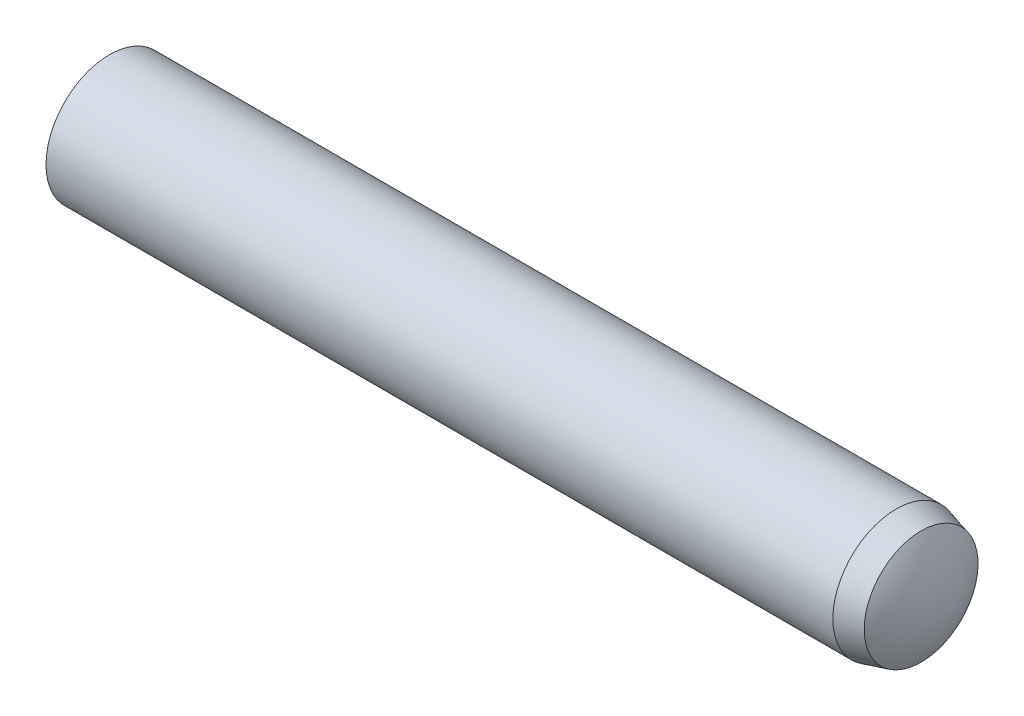
ISO-10303-21;
HEADER;
FILE_DESCRIPTION(('STEP AP214'),'2;1');
FILE_NAME('part.step','',(''),(''),'','','');
FILE_SCHEMA(('AUTOMOTIVE_DESIGN { 1 0 10303 214 1 1 1 1 }'));
ENDSEC;
DATA;
#1=APPLICATION_CONTEXT('core data for automotive mechanical design processes');
#2=APPLICATION_PROTOCOL_DEFINITION('international standard','automotive_design',2000,#1);
#3=PRODUCT_CONTEXT('',#1,'mechanical');
#4=PRODUCT('Part','Part','',(#3));
#5=PRODUCT_RELATED_PRODUCT_CATEGORY('part','',(#4));
#6=PRODUCT_DEFINITION_FORMATION('','',#4);
#7=PRODUCT_DEFINITION_CONTEXT('part definition',#1,'design');
#8=PRODUCT_DEFINITION('design','',#6,#7);
#9=PRODUCT_DEFINITION_SHAPE('','',#8);
#10=(LENGTH_UNIT() NAMED_UNIT(*) SI_UNIT(.MILLI.,.METRE.));
#11=(NAMED_UNIT(*) PLANE_ANGLE_UNIT() SI_UNIT($,.RADIAN.));
#12=(NAMED_UNIT(*) SI_UNIT($,.STERADIAN.) SOLID_ANGLE_UNIT());
#13=UNCERTAINTY_MEASURE_WITH_UNIT(LENGTH_MEASURE(1.E-05),#10,'distance_accuracy_value','');
#14=(GEOMETRIC_REPRESENTATION_CONTEXT(3) GLOBAL_UNCERTAINTY_ASSIGNED_CONTEXT((#13)) GLOBAL_UNIT_ASSIGNED_CONTEXT((#10,
#11,#12)) REPRESENTATION_CONTEXT('',''));
#15=CARTESIAN_POINT('',(0.,0.,0.));
#16=DIRECTION('',(0.,0.,1.));
#17=DIRECTION('',(1.,0.,0.));
#18=AXIS2_PLACEMENT_3D('',#15,#16,#17);
#19=CARTESIAN_POINT('',(-20.,0.,0.));
#20=DIRECTION('',(1.,0.,0.));
#21=DIRECTION('',(0.,0.,-1.));
#22=AXIS2_PLACEMENT_3D('',#19,#20,#21);
#23=CYLINDRICAL_SURFACE('',#22,3.);
#24=CARTESIAN_POINT('',(18.05,0.,0.));
#25=DIRECTION('',(-1.,0.,0.));
#26=DIRECTION('',(0.,0.,1.));
#27=AXIS2_PLACEMENT_3D('',#24,#25,#26);
#28=CIRCLE('',#27,3.);
#29=CARTESIAN_POINT('',(18.05,0.,3.));
#30=VERTEX_POINT('',#29);
#31=EDGE_CURVE('E11',#30,#30,#28,.T.);
#32=ORIENTED_EDGE('',*,*,#31,.T.);
#33=EDGE_LOOP('',(#32));
#34=FACE_BOUND('',#33,.T.);
#35=CARTESIAN_POINT('',(-19.1,0.,0.));
#36=DIRECTION('',(-1.,0.,0.));
#37=DIRECTION('',(0.,0.,1.));
#38=AXIS2_PLACEMENT_3D('',#35,#36,#37);
#39=CIRCLE('',#38,3.);
#40=CARTESIAN_POINT('',(-19.1,0.,3.));
#41=VERTEX_POINT('',#40);
#42=EDGE_CURVE('E51',#41,#41,#39,.T.);
#43=ORIENTED_EDGE('',*,*,#42,.F.);
#44=EDGE_LOOP('',(#43));
#45=FACE_BOUND('',#44,.T.);
#46=ADVANCED_FACE('F31',(#34,#45),#23,.T.);
#47=CARTESIAN_POINT('',(18.05,0.,0.));
#48=DIRECTION('',(-1.,0.,0.));
#49=DIRECTION('',(0.,0.,1.));
#50=AXIS2_PLACEMENT_3D('',#47,#48,#49);
#51=CONICAL_SURFACE('',#50,3.,0.26179938779915);
#52=CARTESIAN_POINT('',(19.22,0.,0.));
#53=DIRECTION('',(-1.,0.,0.));
#54=DIRECTION('',(0.,0.,1.));
#55=AXIS2_PLACEMENT_3D('',#52,#53,#54);
#56=CIRCLE('',#55,2.68649944485558);
#57=CARTESIAN_POINT('',(19.22,0.,2.68649944485558));
#58=VERTEX_POINT('',#57);
#59=EDGE_CURVE('E38',#58,#58,#56,.T.);
#60=ORIENTED_EDGE('',*,*,#59,.T.);
#61=EDGE_LOOP('',(#60));
#62=FACE_BOUND('',#61,.T.);
#63=ORIENTED_EDGE('',*,*,#31,.F.);
#64=EDGE_LOOP('',(#63));
#65=FACE_BOUND('',#64,.T.);
#66=ADVANCED_FACE('F57',(#62,#65),#51,.T.);
#67=CARTESIAN_POINT('',(14.9835389312761,0.,0.));
#68=DIRECTION('',(-1.,0.,0.));
#69=DIRECTION('',(0.,1.,0.));
#70=AXIS2_PLACEMENT_3D('',#67,#68,#69);
#71=SPHERICAL_SURFACE('',#70,5.01646106872393);
#72=CARTESIAN_POINT('',(20.,0.,0.));
#73=VERTEX_POINT('',#72);
#74=VERTEX_LOOP('',#73);
#75=FACE_BOUND('',#74,.T.);
#76=ORIENTED_EDGE('',*,*,#59,.F.);
#77=EDGE_LOOP('',(#76));
#78=FACE_BOUND('',#77,.T.);
#79=ADVANCED_FACE('F47',(#75,#78),#71,.T.);
#80=CARTESIAN_POINT('',(-14.55,0.,0.));
#81=DIRECTION('',(-1.,0.,0.));
#82=DIRECTION('',(0.,-1.,0.));
#83=AXIS2_PLACEMENT_3D('',#80,#81,#82);
#84=SPHERICAL_SURFACE('',#83,5.44999999999999);
#85=CARTESIAN_POINT('',(-20.,0.,0.));
#86=VERTEX_POINT('',#85);
#87=VERTEX_LOOP('',#86);
#88=FACE_BOUND('',#87,.T.);
#89=ORIENTED_EDGE('',*,*,#42,.T.);
#90=EDGE_LOOP('',(#89));
#91=FACE_BOUND('',#90,.T.);
#92=ADVANCED_FACE('F44',(#88,#91),#84,.T.);
#93=CLOSED_SHELL('',(#46,#66,#79,#92));
#94=MANIFOLD_SOLID_BREP('B2',#93);
#95=ADVANCED_BREP_SHAPE_REPRESENTATION('',(#18,#94),#14);
#96=SHAPE_DEFINITION_REPRESENTATION(#9,#95);
ENDSEC;
END-ISO-10303-21;
